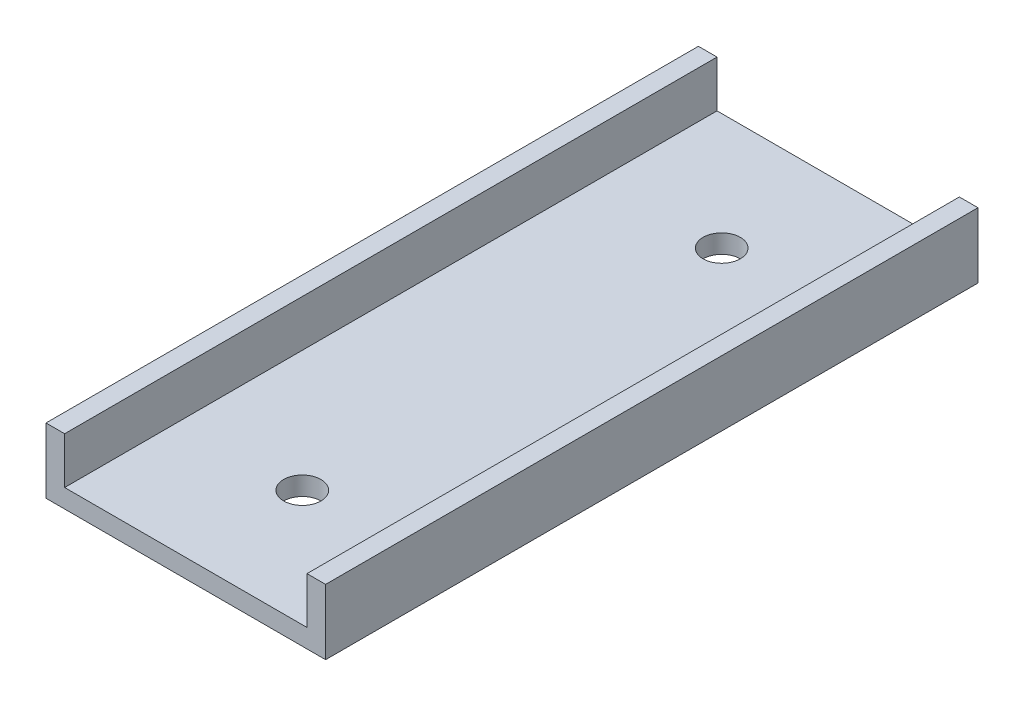
ISO-10303-21;
HEADER;
FILE_DESCRIPTION(('STEP AP214'),'2;1');
FILE_NAME('part.step','',(''),(''),'','','');
FILE_SCHEMA(('AUTOMOTIVE_DESIGN { 1 0 10303 214 1 1 1 1 }'));
ENDSEC;
DATA;
#1=APPLICATION_CONTEXT('core data for automotive mechanical design processes');
#2=APPLICATION_PROTOCOL_DEFINITION('international standard','automotive_design',2000,#1);
#3=PRODUCT_CONTEXT('',#1,'mechanical');
#4=PRODUCT('Part','Part','',(#3));
#5=PRODUCT_RELATED_PRODUCT_CATEGORY('part','',(#4));
#6=PRODUCT_DEFINITION_FORMATION('','',#4);
#7=PRODUCT_DEFINITION_CONTEXT('part definition',#1,'design');
#8=PRODUCT_DEFINITION('design','',#6,#7);
#9=PRODUCT_DEFINITION_SHAPE('','',#8);
#10=(LENGTH_UNIT() NAMED_UNIT(*) SI_UNIT(.MILLI.,.METRE.));
#11=(NAMED_UNIT(*) PLANE_ANGLE_UNIT() SI_UNIT($,.RADIAN.));
#12=(NAMED_UNIT(*) SI_UNIT($,.STERADIAN.) SOLID_ANGLE_UNIT());
#13=UNCERTAINTY_MEASURE_WITH_UNIT(LENGTH_MEASURE(1.E-05),#10,'distance_accuracy_value','');
#14=(GEOMETRIC_REPRESENTATION_CONTEXT(3) GLOBAL_UNCERTAINTY_ASSIGNED_CONTEXT((#13)) GLOBAL_UNIT_ASSIGNED_CONTEXT((#10,
#11,#12)) REPRESENTATION_CONTEXT('',''));
#15=CARTESIAN_POINT('',(0.,0.,0.));
#16=DIRECTION('',(0.,0.,1.));
#17=DIRECTION('',(1.,0.,0.));
#18=AXIS2_PLACEMENT_3D('',#15,#16,#17);
#19=CARTESIAN_POINT('',(-37.7390585034568,13.5785497707736,70.));
#20=DIRECTION('',(0.,-1.,0.));
#21=DIRECTION('',(0.,0.,-1.));
#22=AXIS2_PLACEMENT_3D('',#19,#20,#21);
#23=PLANE('',#22);
#24=DIRECTION('',(-1.,0.,0.));
#25=VECTOR('',#24,1.);
#26=CARTESIAN_POINT('',(-37.7390585034568,13.5785497707736,0.));
#27=LINE('',#26,#25);
#28=CARTESIAN_POINT('',(-37.7390585034568,13.5785497707736,0.));
#29=VERTEX_POINT('',#28);
#30=CARTESIAN_POINT('',(-39.7390585034568,13.5785497707736,0.));
#31=VERTEX_POINT('',#30);
#32=EDGE_CURVE('E133',#29,#31,#27,.T.);
#33=ORIENTED_EDGE('',*,*,#32,.T.);
#34=DIRECTION('',(0.,0.,-1.));
#35=VECTOR('',#34,1.);
#36=CARTESIAN_POINT('',(-39.7390585034568,13.5785497707736,70.));
#37=LINE('',#36,#35);
#38=CARTESIAN_POINT('',(-39.7390585034568,13.5785497707736,70.));
#39=VERTEX_POINT('',#38);
#40=EDGE_CURVE('E11',#39,#31,#37,.T.);
#41=ORIENTED_EDGE('',*,*,#40,.F.);
#42=DIRECTION('',(-1.,0.,0.));
#43=VECTOR('',#42,1.);
#44=CARTESIAN_POINT('',(-37.7390585034568,13.5785497707736,70.));
#45=LINE('',#44,#43);
#46=CARTESIAN_POINT('',(-37.7390585034568,13.5785497707736,70.));
#47=VERTEX_POINT('',#46);
#48=EDGE_CURVE('E147',#47,#39,#45,.T.);
#49=ORIENTED_EDGE('',*,*,#48,.F.);
#50=DIRECTION('',(0.,0.,-1.));
#51=VECTOR('',#50,1.);
#52=CARTESIAN_POINT('',(-37.7390585034568,13.5785497707736,70.));
#53=LINE('',#52,#51);
#54=EDGE_CURVE('E129',#47,#29,#53,.T.);
#55=ORIENTED_EDGE('',*,*,#54,.T.);
#56=EDGE_LOOP('',(#33,#41,#49,#55));
#57=FACE_BOUND('',#56,.T.);
#58=ADVANCED_FACE('F35',(#57),#23,.F.);
#59=CARTESIAN_POINT('',(-39.7390585034568,13.5785497707736,70.));
#60=DIRECTION('',(1.,0.,0.));
#61=DIRECTION('',(0.,0.,-1.));
#62=AXIS2_PLACEMENT_3D('',#59,#60,#61);
#63=PLANE('',#62);
#64=DIRECTION('',(0.,-1.,0.));
#65=VECTOR('',#64,1.);
#66=CARTESIAN_POINT('',(-39.7390585034568,13.5785497707736,0.));
#67=LINE('',#66,#65);
#68=CARTESIAN_POINT('',(-39.7390585034568,6.57854977077362,0.));
#69=VERTEX_POINT('',#68);
#70=EDGE_CURVE('E136',#31,#69,#67,.T.);
#71=ORIENTED_EDGE('',*,*,#70,.T.);
#72=DIRECTION('',(0.,0.,-1.));
#73=VECTOR('',#72,1.);
#74=CARTESIAN_POINT('',(-39.7390585034568,6.57854977077362,70.));
#75=LINE('',#74,#73);
#76=CARTESIAN_POINT('',(-39.7390585034568,6.57854977077362,70.));
#77=VERTEX_POINT('',#76);
#78=EDGE_CURVE('E44',#77,#69,#75,.T.);
#79=ORIENTED_EDGE('',*,*,#78,.F.);
#80=DIRECTION('',(0.,-1.,0.));
#81=VECTOR('',#80,1.);
#82=CARTESIAN_POINT('',(-39.7390585034568,13.5785497707736,70.));
#83=LINE('',#82,#81);
#84=EDGE_CURVE('E96',#39,#77,#83,.T.);
#85=ORIENTED_EDGE('',*,*,#84,.F.);
#86=ORIENTED_EDGE('',*,*,#40,.T.);
#87=EDGE_LOOP('',(#71,#79,#85,#86));
#88=FACE_BOUND('',#87,.T.);
#89=ADVANCED_FACE('F206',(#88),#63,.F.);
#90=CARTESIAN_POINT('',(-39.7390585034568,6.57854977077362,70.));
#91=DIRECTION('',(0.,1.,0.));
#92=DIRECTION('',(0.,0.,1.));
#93=AXIS2_PLACEMENT_3D('',#90,#91,#92);
#94=PLANE('',#93);
#95=CARTESIAN_POINT('',(-24.7390585034568,6.57854977077362,12.5));
#96=DIRECTION('',(0.,-1.,0.));
#97=DIRECTION('',(0.,0.,-1.));
#98=AXIS2_PLACEMENT_3D('',#95,#96,#97);
#99=CIRCLE('',#98,2.);
#100=CARTESIAN_POINT('',(-24.7390585034568,6.57854977077362,10.5));
#101=VERTEX_POINT('',#100);
#102=EDGE_CURVE('E160',#101,#101,#99,.T.);
#103=ORIENTED_EDGE('',*,*,#102,.F.);
#104=EDGE_LOOP('',(#103));
#105=FACE_BOUND('',#104,.T.);
#106=CARTESIAN_POINT('',(-24.7390585034568,6.57854977077362,57.5));
#107=DIRECTION('',(0.,-1.,0.));
#108=DIRECTION('',(0.,0.,1.));
#109=AXIS2_PLACEMENT_3D('',#106,#107,#108);
#110=CIRCLE('',#109,2.);
#111=CARTESIAN_POINT('',(-24.7390585034568,6.57854977077362,59.5));
#112=VERTEX_POINT('',#111);
#113=EDGE_CURVE('E165',#112,#112,#110,.T.);
#114=ORIENTED_EDGE('',*,*,#113,.F.);
#115=EDGE_LOOP('',(#114));
#116=FACE_BOUND('',#115,.T.);
#117=DIRECTION('',(1.,0.,0.));
#118=VECTOR('',#117,1.);
#119=CARTESIAN_POINT('',(-39.7390585034568,6.57854977077362,0.));
#120=LINE('',#119,#118);
#121=CARTESIAN_POINT('',(-9.73905850345677,6.57854977077362,0.));
#122=VERTEX_POINT('',#121);
#123=EDGE_CURVE('E138',#69,#122,#120,.T.);
#124=ORIENTED_EDGE('',*,*,#123,.T.);
#125=DIRECTION('',(0.,0.,-1.));
#126=VECTOR('',#125,1.);
#127=CARTESIAN_POINT('',(-9.73905850345677,6.57854977077362,70.));
#128=LINE('',#127,#126);
#129=CARTESIAN_POINT('',(-9.73905850345677,6.57854977077362,70.));
#130=VERTEX_POINT('',#129);
#131=EDGE_CURVE('E154',#130,#122,#128,.T.);
#132=ORIENTED_EDGE('',*,*,#131,.F.);
#133=DIRECTION('',(1.,0.,0.));
#134=VECTOR('',#133,1.);
#135=CARTESIAN_POINT('',(-39.7390585034568,6.57854977077362,70.));
#136=LINE('',#135,#134);
#137=EDGE_CURVE('E174',#77,#130,#136,.T.);
#138=ORIENTED_EDGE('',*,*,#137,.F.);
#139=ORIENTED_EDGE('',*,*,#78,.T.);
#140=EDGE_LOOP('',(#124,#132,#138,#139));
#141=FACE_BOUND('',#140,.T.);
#142=ADVANCED_FACE('F210',(#105,#116,#141),#94,.F.);
#143=CARTESIAN_POINT('',(-9.73905850345677,6.57854977077362,70.));
#144=DIRECTION('',(-1.,0.,0.));
#145=DIRECTION('',(0.,0.,1.));
#146=AXIS2_PLACEMENT_3D('',#143,#144,#145);
#147=PLANE('',#146);
#148=DIRECTION('',(0.,1.,0.));
#149=VECTOR('',#148,1.);
#150=CARTESIAN_POINT('',(-9.73905850345677,6.57854977077362,0.));
#151=LINE('',#150,#149);
#152=CARTESIAN_POINT('',(-9.73905850345677,13.5785497707736,0.));
#153=VERTEX_POINT('',#152);
#154=EDGE_CURVE('E140',#122,#153,#151,.T.);
#155=ORIENTED_EDGE('',*,*,#154,.T.);
#156=DIRECTION('',(0.,0.,-1.));
#157=VECTOR('',#156,1.);
#158=CARTESIAN_POINT('',(-9.73905850345677,13.5785497707736,70.));
#159=LINE('',#158,#157);
#160=CARTESIAN_POINT('',(-9.73905850345677,13.5785497707736,70.));
#161=VERTEX_POINT('',#160);
#162=EDGE_CURVE('E151',#161,#153,#159,.T.);
#163=ORIENTED_EDGE('',*,*,#162,.F.);
#164=DIRECTION('',(0.,1.,0.));
#165=VECTOR('',#164,1.);
#166=CARTESIAN_POINT('',(-9.73905850345677,6.57854977077362,70.));
#167=LINE('',#166,#165);
#168=EDGE_CURVE('E176',#130,#161,#167,.T.);
#169=ORIENTED_EDGE('',*,*,#168,.F.);
#170=ORIENTED_EDGE('',*,*,#131,.T.);
#171=EDGE_LOOP('',(#155,#163,#169,#170));
#172=FACE_BOUND('',#171,.T.);
#173=ADVANCED_FACE('F182',(#172),#147,.F.);
#174=CARTESIAN_POINT('',(-9.73905850345677,13.5785497707736,70.));
#175=DIRECTION('',(0.,-1.,0.));
#176=DIRECTION('',(0.,0.,-1.));
#177=AXIS2_PLACEMENT_3D('',#174,#175,#176);
#178=PLANE('',#177);
#179=DIRECTION('',(-1.,0.,0.));
#180=VECTOR('',#179,1.);
#181=CARTESIAN_POINT('',(-9.73905850345677,13.5785497707736,0.));
#182=LINE('',#181,#180);
#183=CARTESIAN_POINT('',(-11.7390585034568,13.5785497707736,0.));
#184=VERTEX_POINT('',#183);
#185=EDGE_CURVE('E142',#153,#184,#182,.T.);
#186=ORIENTED_EDGE('',*,*,#185,.T.);
#187=DIRECTION('',(0.,0.,-1.));
#188=VECTOR('',#187,1.);
#189=CARTESIAN_POINT('',(-11.7390585034568,13.5785497707736,70.));
#190=LINE('',#189,#188);
#191=CARTESIAN_POINT('',(-11.7390585034568,13.5785497707736,70.));
#192=VERTEX_POINT('',#191);
#193=EDGE_CURVE('E124',#192,#184,#190,.T.);
#194=ORIENTED_EDGE('',*,*,#193,.F.);
#195=DIRECTION('',(-1.,0.,0.));
#196=VECTOR('',#195,1.);
#197=CARTESIAN_POINT('',(-9.73905850345677,13.5785497707736,70.));
#198=LINE('',#197,#196);
#199=EDGE_CURVE('E115',#161,#192,#198,.T.);
#200=ORIENTED_EDGE('',*,*,#199,.F.);
#201=ORIENTED_EDGE('',*,*,#162,.T.);
#202=EDGE_LOOP('',(#186,#194,#200,#201));
#203=FACE_BOUND('',#202,.T.);
#204=ADVANCED_FACE('F186',(#203),#178,.F.);
#205=CARTESIAN_POINT('',(-11.7390585034568,13.5785497707736,70.));
#206=DIRECTION('',(1.,0.,0.));
#207=DIRECTION('',(0.,0.,-1.));
#208=AXIS2_PLACEMENT_3D('',#205,#206,#207);
#209=PLANE('',#208);
#210=DIRECTION('',(0.,-1.,0.));
#211=VECTOR('',#210,1.);
#212=CARTESIAN_POINT('',(-11.7390585034568,13.5785497707736,0.));
#213=LINE('',#212,#211);
#214=CARTESIAN_POINT('',(-11.7390585034568,8.57854977077362,0.));
#215=VERTEX_POINT('',#214);
#216=EDGE_CURVE('E123',#184,#215,#213,.T.);
#217=ORIENTED_EDGE('',*,*,#216,.T.);
#218=DIRECTION('',(0.,0.,-1.));
#219=VECTOR('',#218,1.);
#220=CARTESIAN_POINT('',(-11.7390585034568,8.57854977077362,70.));
#221=LINE('',#220,#219);
#222=CARTESIAN_POINT('',(-11.7390585034568,8.57854977077362,70.));
#223=VERTEX_POINT('',#222);
#224=EDGE_CURVE('E120',#223,#215,#221,.T.);
#225=ORIENTED_EDGE('',*,*,#224,.F.);
#226=DIRECTION('',(0.,-1.,0.));
#227=VECTOR('',#226,1.);
#228=CARTESIAN_POINT('',(-11.7390585034568,13.5785497707736,70.));
#229=LINE('',#228,#227);
#230=EDGE_CURVE('E109',#192,#223,#229,.T.);
#231=ORIENTED_EDGE('',*,*,#230,.F.);
#232=ORIENTED_EDGE('',*,*,#193,.T.);
#233=EDGE_LOOP('',(#217,#225,#231,#232));
#234=FACE_BOUND('',#233,.T.);
#235=ADVANCED_FACE('F121',(#234),#209,.F.);
#236=CARTESIAN_POINT('',(-11.7390585034568,8.57854977077362,70.));
#237=DIRECTION('',(0.,-1.,0.));
#238=DIRECTION('',(0.,0.,-1.));
#239=AXIS2_PLACEMENT_3D('',#236,#237,#238);
#240=PLANE('',#239);
#241=CARTESIAN_POINT('',(-24.7390585034568,8.57854977077362,12.5));
#242=DIRECTION('',(0.,-1.,0.));
#243=DIRECTION('',(0.,0.,-1.));
#244=AXIS2_PLACEMENT_3D('',#241,#242,#243);
#245=CIRCLE('',#244,2.);
#246=CARTESIAN_POINT('',(-24.7390585034568,8.57854977077362,10.5));
#247=VERTEX_POINT('',#246);
#248=EDGE_CURVE('E38',#247,#247,#245,.T.);
#249=ORIENTED_EDGE('',*,*,#248,.T.);
#250=EDGE_LOOP('',(#249));
#251=FACE_BOUND('',#250,.T.);
#252=CARTESIAN_POINT('',(-24.7390585034568,8.57854977077362,57.5));
#253=DIRECTION('',(0.,-1.,0.));
#254=DIRECTION('',(0.,0.,-1.));
#255=AXIS2_PLACEMENT_3D('',#252,#253,#254);
#256=CIRCLE('',#255,2.);
#257=CARTESIAN_POINT('',(-24.7390585034568,8.57854977077362,55.5));
#258=VERTEX_POINT('',#257);
#259=EDGE_CURVE('E158',#258,#258,#256,.T.);
#260=ORIENTED_EDGE('',*,*,#259,.T.);
#261=EDGE_LOOP('',(#260));
#262=FACE_BOUND('',#261,.T.);
#263=DIRECTION('',(-1.,0.,0.));
#264=VECTOR('',#263,1.);
#265=CARTESIAN_POINT('',(-11.7390585034568,8.57854977077362,0.));
#266=LINE('',#265,#264);
#267=CARTESIAN_POINT('',(-37.7390585034568,8.57854977077362,0.));
#268=VERTEX_POINT('',#267);
#269=EDGE_CURVE('E82',#215,#268,#266,.T.);
#270=ORIENTED_EDGE('',*,*,#269,.T.);
#271=DIRECTION('',(0.,0.,-1.));
#272=VECTOR('',#271,1.);
#273=CARTESIAN_POINT('',(-37.7390585034568,8.57854977077362,70.));
#274=LINE('',#273,#272);
#275=CARTESIAN_POINT('',(-37.7390585034568,8.57854977077362,70.));
#276=VERTEX_POINT('',#275);
#277=EDGE_CURVE('E125',#276,#268,#274,.T.);
#278=ORIENTED_EDGE('',*,*,#277,.F.);
#279=DIRECTION('',(-1.,0.,0.));
#280=VECTOR('',#279,1.);
#281=CARTESIAN_POINT('',(-11.7390585034568,8.57854977077362,70.));
#282=LINE('',#281,#280);
#283=EDGE_CURVE('E113',#223,#276,#282,.T.);
#284=ORIENTED_EDGE('',*,*,#283,.F.);
#285=ORIENTED_EDGE('',*,*,#224,.T.);
#286=EDGE_LOOP('',(#270,#278,#284,#285));
#287=FACE_BOUND('',#286,.T.);
#288=ADVANCED_FACE('F127',(#251,#262,#287),#240,.F.);
#289=CARTESIAN_POINT('',(-37.7390585034568,8.57854977077362,70.));
#290=DIRECTION('',(-1.,0.,0.));
#291=DIRECTION('',(0.,0.,1.));
#292=AXIS2_PLACEMENT_3D('',#289,#290,#291);
#293=PLANE('',#292);
#294=DIRECTION('',(0.,1.,0.));
#295=VECTOR('',#294,1.);
#296=CARTESIAN_POINT('',(-37.7390585034568,8.57854977077362,0.));
#297=LINE('',#296,#295);
#298=EDGE_CURVE('E88',#268,#29,#297,.T.);
#299=ORIENTED_EDGE('',*,*,#298,.T.);
#300=ORIENTED_EDGE('',*,*,#54,.F.);
#301=DIRECTION('',(0.,1.,0.));
#302=VECTOR('',#301,1.);
#303=CARTESIAN_POINT('',(-37.7390585034568,8.57854977077362,70.));
#304=LINE('',#303,#302);
#305=EDGE_CURVE('E53',#276,#47,#304,.T.);
#306=ORIENTED_EDGE('',*,*,#305,.F.);
#307=ORIENTED_EDGE('',*,*,#277,.T.);
#308=EDGE_LOOP('',(#299,#300,#306,#307));
#309=FACE_BOUND('',#308,.T.);
#310=ADVANCED_FACE('F194',(#309),#293,.F.);
#311=CARTESIAN_POINT('',(0.,0.,70.));
#312=DIRECTION('',(0.,0.,1.));
#313=DIRECTION('',(1.,0.,0.));
#314=AXIS2_PLACEMENT_3D('',#311,#312,#313);
#315=PLANE('',#314);
#316=ORIENTED_EDGE('',*,*,#48,.T.);
#317=ORIENTED_EDGE('',*,*,#84,.T.);
#318=ORIENTED_EDGE('',*,*,#137,.T.);
#319=ORIENTED_EDGE('',*,*,#168,.T.);
#320=ORIENTED_EDGE('',*,*,#199,.T.);
#321=ORIENTED_EDGE('',*,*,#230,.T.);
#322=ORIENTED_EDGE('',*,*,#283,.T.);
#323=ORIENTED_EDGE('',*,*,#305,.T.);
#324=EDGE_LOOP('',(#316,#317,#318,#319,#320,#321,#322,#323));
#325=FACE_BOUND('',#324,.T.);
#326=ADVANCED_FACE('F111',(#325),#315,.T.);
#327=CARTESIAN_POINT('',(0.,0.,0.));
#328=DIRECTION('',(0.,0.,1.));
#329=DIRECTION('',(1.,0.,0.));
#330=AXIS2_PLACEMENT_3D('',#327,#328,#329);
#331=PLANE('',#330);
#332=ORIENTED_EDGE('',*,*,#32,.F.);
#333=ORIENTED_EDGE('',*,*,#298,.F.);
#334=ORIENTED_EDGE('',*,*,#269,.F.);
#335=ORIENTED_EDGE('',*,*,#216,.F.);
#336=ORIENTED_EDGE('',*,*,#185,.F.);
#337=ORIENTED_EDGE('',*,*,#154,.F.);
#338=ORIENTED_EDGE('',*,*,#123,.F.);
#339=ORIENTED_EDGE('',*,*,#70,.F.);
#340=EDGE_LOOP('',(#332,#333,#334,#335,#336,#337,#338,#339));
#341=FACE_BOUND('',#340,.T.);
#342=ADVANCED_FACE('F189',(#341),#331,.F.);
#343=CARTESIAN_POINT('',(-24.7390585034568,76.5785497707736,57.5));
#344=DIRECTION('',(0.,-1.,0.));
#345=DIRECTION('',(0.,0.,-1.));
#346=AXIS2_PLACEMENT_3D('',#343,#344,#345);
#347=CYLINDRICAL_SURFACE('',#346,2.);
#348=ORIENTED_EDGE('',*,*,#113,.T.);
#349=EDGE_LOOP('',(#348));
#350=FACE_BOUND('',#349,.T.);
#351=ORIENTED_EDGE('',*,*,#259,.F.);
#352=EDGE_LOOP('',(#351));
#353=FACE_BOUND('',#352,.T.);
#354=ADVANCED_FACE('F240',(#350,#353),#347,.F.);
#355=CARTESIAN_POINT('',(-24.7390585034568,76.5785497707736,12.5));
#356=DIRECTION('',(0.,-1.,0.));
#357=DIRECTION('',(0.,0.,-1.));
#358=AXIS2_PLACEMENT_3D('',#355,#356,#357);
#359=CYLINDRICAL_SURFACE('',#358,2.);
#360=ORIENTED_EDGE('',*,*,#102,.T.);
#361=EDGE_LOOP('',(#360));
#362=FACE_BOUND('',#361,.T.);
#363=ORIENTED_EDGE('',*,*,#248,.F.);
#364=EDGE_LOOP('',(#363));
#365=FACE_BOUND('',#364,.T.);
#366=ADVANCED_FACE('F245',(#362,#365),#359,.F.);
#367=CLOSED_SHELL('',(#58,#89,#142,#173,#204,#235,#288,#310,#326,#342,#354,#366));
#368=MANIFOLD_SOLID_BREP('B2',#367);
#369=ADVANCED_BREP_SHAPE_REPRESENTATION('',(#18,#368),#14);
#370=SHAPE_DEFINITION_REPRESENTATION(#9,#369);
ENDSEC;
END-ISO-10303-21;
